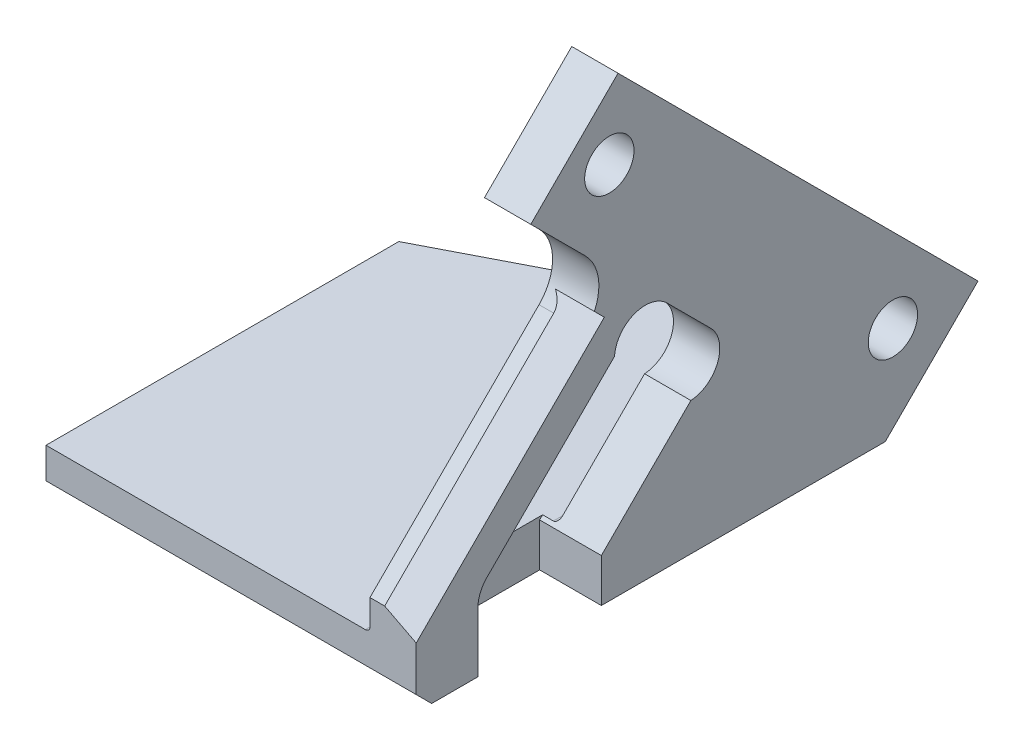
ISO-10303-21;
HEADER;
FILE_DESCRIPTION(('STEP AP214'),'2;1');
FILE_NAME('part.step','',(''),(''),'','','');
FILE_SCHEMA(('AUTOMOTIVE_DESIGN { 1 0 10303 214 1 1 1 1 }'));
ENDSEC;
DATA;
#1=APPLICATION_CONTEXT('core data for automotive mechanical design processes');
#2=APPLICATION_PROTOCOL_DEFINITION('international standard','automotive_design',2000,#1);
#3=PRODUCT_CONTEXT('',#1,'mechanical');
#4=PRODUCT('Part','Part','',(#3));
#5=PRODUCT_RELATED_PRODUCT_CATEGORY('part','',(#4));
#6=PRODUCT_DEFINITION_FORMATION('','',#4);
#7=PRODUCT_DEFINITION_CONTEXT('part definition',#1,'design');
#8=PRODUCT_DEFINITION('design','',#6,#7);
#9=PRODUCT_DEFINITION_SHAPE('','',#8);
#10=(LENGTH_UNIT() NAMED_UNIT(*) SI_UNIT(.MILLI.,.METRE.));
#11=(NAMED_UNIT(*) PLANE_ANGLE_UNIT() SI_UNIT($,.RADIAN.));
#12=(NAMED_UNIT(*) SI_UNIT($,.STERADIAN.) SOLID_ANGLE_UNIT());
#13=UNCERTAINTY_MEASURE_WITH_UNIT(LENGTH_MEASURE(1.E-05),#10,'distance_accuracy_value','');
#14=(GEOMETRIC_REPRESENTATION_CONTEXT(3) GLOBAL_UNCERTAINTY_ASSIGNED_CONTEXT((#13)) GLOBAL_UNIT_ASSIGNED_CONTEXT((#10,
#11,#12)) REPRESENTATION_CONTEXT('',''));
#15=CARTESIAN_POINT('',(0.,0.,0.));
#16=DIRECTION('',(0.,0.,1.));
#17=DIRECTION('',(1.,0.,0.));
#18=AXIS2_PLACEMENT_3D('',#15,#16,#17);
#19=CARTESIAN_POINT('',(3.,35.,40.));
#20=DIRECTION('',(-1.,0.,0.));
#21=DIRECTION('',(0.,-1.,0.));
#22=AXIS2_PLACEMENT_3D('',#19,#20,#21);
#23=PLANE('',#22);
#24=CARTESIAN_POINT('',(3.,3.1084026149607,9.09843368765678));
#25=DIRECTION('',(1.,0.,0.));
#26=DIRECTION('',(0.,0.,-1.));
#27=AXIS2_PLACEMENT_3D('',#24,#25,#26);
#28=CIRCLE('',#27,1.6);
#29=CARTESIAN_POINT('',(3.,3.1084026149607,7.49843368765678));
#30=VERTEX_POINT('',#29);
#31=EDGE_CURVE('E812',#30,#30,#28,.T.);
#32=ORIENTED_EDGE('',*,*,#31,.F.);
#33=EDGE_LOOP('',(#32));
#34=FACE_BOUND('',#33,.T.);
#35=DIRECTION('',(0.,1.,0.));
#36=VECTOR('',#35,1.);
#37=CARTESIAN_POINT('',(3.,35.,40.));
#38=LINE('',#37,#36);
#39=CARTESIAN_POINT('',(3.00000000000001,-1.99999999999998,40.));
#40=VERTEX_POINT('',#39);
#41=CARTESIAN_POINT('',(3.00000000000001,0.896265221277836,40.));
#42=VERTEX_POINT('',#41);
#43=EDGE_CURVE('E349',#40,#42,#38,.T.);
#44=ORIENTED_EDGE('',*,*,#43,.F.);
#45=DIRECTION('',(0.,-0.707106781186545,-0.70710678118655));
#46=VECTOR('',#45,1.);
#47=CARTESIAN_POINT('',(3.00000000000001,-1.99999999999999,40.));
#48=LINE('',#47,#46);
#49=CARTESIAN_POINT('',(3.00000000000001,-3.,39.));
#50=VERTEX_POINT('',#49);
#51=EDGE_CURVE('E401',#40,#50,#48,.T.);
#52=ORIENTED_EDGE('',*,*,#51,.T.);
#53=DIRECTION('',(0.,0.,-1.));
#54=VECTOR('',#53,1.);
#55=CARTESIAN_POINT('',(3.00000000000001,-3.,40.));
#56=LINE('',#55,#54);
#57=CARTESIAN_POINT('',(3.00000000000001,-3.,36.));
#58=VERTEX_POINT('',#57);
#59=EDGE_CURVE('E354',#50,#58,#56,.T.);
#60=ORIENTED_EDGE('',*,*,#59,.T.);
#61=DIRECTION('',(0.,-1.,0.));
#62=VECTOR('',#61,1.);
#63=CARTESIAN_POINT('',(3.,11.6724657096209,36.));
#64=LINE('',#63,#62);
#65=CARTESIAN_POINT('',(3.,0.87867965644039,36.));
#66=VERTEX_POINT('',#65);
#67=EDGE_CURVE('E266',#66,#58,#64,.T.);
#68=ORIENTED_EDGE('',*,*,#67,.F.);
#69=CARTESIAN_POINT('',(3.,0.878679656440391,34.));
#70=DIRECTION('',(1.,0.,0.));
#71=DIRECTION('',(0.,1.,0.));
#72=AXIS2_PLACEMENT_3D('',#69,#70,#71);
#73=CIRCLE('',#72,2.);
#74=CARTESIAN_POINT('',(3.,2.29289321881349,35.4142135623731));
#75=VERTEX_POINT('',#74);
#76=EDGE_CURVE('E263',#75,#66,#73,.T.);
#77=ORIENTED_EDGE('',*,*,#76,.F.);
#78=DIRECTION('',(0.,-0.707106781186548,0.707106781186547));
#79=VECTOR('',#78,1.);
#80=CARTESIAN_POINT('',(3.,32.0529975628686,5.65410921831808));
#81=LINE('',#80,#79);
#82=CARTESIAN_POINT('',(3.,10.5602746676308,27.1468321135558));
#83=VERTEX_POINT('',#82);
#84=EDGE_CURVE('E260',#83,#75,#81,.T.);
#85=ORIENTED_EDGE('',*,*,#84,.F.);
#86=CARTESIAN_POINT('',(3.,10.4350288425444,25.1507575950825));
#87=DIRECTION('',(1.,0.,0.));
#88=DIRECTION('',(0.,1.,0.));
#89=AXIS2_PLACEMENT_3D('',#86,#87,#88);
#90=CIRCLE('',#89,2.);
#91=CARTESIAN_POINT('',(3.,11.8492424049175,23.7365440327094));
#92=VERTEX_POINT('',#91);
#93=EDGE_CURVE('E257',#92,#83,#90,.T.);
#94=ORIENTED_EDGE('',*,*,#93,.F.);
#95=DIRECTION('',(0.,0.707106781186548,0.707106781186547));
#96=VECTOR('',#95,1.);
#97=CARTESIAN_POINT('',(3.00000000000001,-7.47062927655033,4.41667235124159));
#98=LINE('',#97,#96);
#99=CARTESIAN_POINT('',(3.,9.02081528017135,20.9081169079632));
#100=VERTEX_POINT('',#99);
#101=EDGE_CURVE('E243',#100,#92,#98,.T.);
#102=ORIENTED_EDGE('',*,*,#101,.F.);
#103=CARTESIAN_POINT('',(3.,7.60660171779825,22.3223304703363));
#104=DIRECTION('',(1.,0.,0.));
#105=DIRECTION('',(0.,1.,0.));
#106=AXIS2_PLACEMENT_3D('',#103,#104,#105);
#107=CIRCLE('',#106,2.);
#108=CARTESIAN_POINT('',(3.,5.61052719932495,22.19708464525));
#109=VERTEX_POINT('',#108);
#110=EDGE_CURVE('E247',#109,#100,#107,.T.);
#111=ORIENTED_EDGE('',*,*,#110,.F.);
#112=DIRECTION('',(0.,0.707106781186547,-0.707106781186548));
#113=VECTOR('',#112,1.);
#114=CARTESIAN_POINT('',(3.,27.1032500945627,0.704361750012202));
#115=LINE('',#114,#113);
#116=CARTESIAN_POINT('',(3.,-0.192388155425081,28.));
#117=VERTEX_POINT('',#116);
#118=EDGE_CURVE('E272',#117,#109,#115,.T.);
#119=ORIENTED_EDGE('',*,*,#118,.F.);
#120=DIRECTION('',(0.,-1.,0.));
#121=VECTOR('',#120,1.);
#122=CARTESIAN_POINT('',(3.,11.6724657096209,28.));
#123=LINE('',#122,#121);
#124=CARTESIAN_POINT('',(3.00000000000001,-3.,28.));
#125=VERTEX_POINT('',#124);
#126=EDGE_CURVE('E269',#117,#125,#123,.T.);
#127=ORIENTED_EDGE('',*,*,#126,.T.);
#128=CARTESIAN_POINT('',(3.00000000000001,-3.,9.59440840897853));
#129=VERTEX_POINT('',#128);
#130=EDGE_CURVE('E353',#125,#129,#56,.T.);
#131=ORIENTED_EDGE('',*,*,#130,.T.);
#132=DIRECTION('',(0.,0.707106781186549,-0.707106781186547));
#133=VECTOR('',#132,1.);
#134=CARTESIAN_POINT('',(3.,0.797204204489303,5.79720420448923));
#135=LINE('',#134,#133);
#136=CARTESIAN_POINT('',(3.,3.0104076400857,3.58400076889284));
#137=VERTEX_POINT('',#136);
#138=EDGE_CURVE('E335',#129,#137,#135,.T.);
#139=ORIENTED_EDGE('',*,*,#138,.T.);
#140=DIRECTION('',(0.,0.707106781186546,0.707106781186549));
#141=VECTOR('',#140,1.);
#142=CARTESIAN_POINT('',(3.,37.2132034355964,37.7867965644036));
#143=LINE('',#142,#141);
#144=CARTESIAN_POINT('',(3.,26.3449314192417,26.9185245480489));
#145=VERTEX_POINT('',#144);
#146=EDGE_CURVE('E337',#137,#145,#143,.T.);
#147=ORIENTED_EDGE('',*,*,#146,.T.);
#148=DIRECTION('',(0.,-0.707106781186548,0.707106781186547));
#149=VECTOR('',#148,1.);
#150=CARTESIAN_POINT('',(3.,24.1317279836453,29.1317279836453));
#151=LINE('',#150,#149);
#152=CARTESIAN_POINT('',(3.,20.6880771697493,32.5753787975413));
#153=VERTEX_POINT('',#152);
#154=EDGE_CURVE('E339',#145,#153,#151,.T.);
#155=ORIENTED_EDGE('',*,*,#154,.T.);
#156=DIRECTION('',(0.,-0.707106781186546,-0.707106781186549));
#157=VECTOR('',#156,1.);
#158=CARTESIAN_POINT('',(3.,31.556349186104,43.443650813896));
#159=LINE('',#158,#157);
#160=CARTESIAN_POINT('',(3.,17.1525432638166,29.0398448916086));
#161=VERTEX_POINT('',#160);
#162=EDGE_CURVE('E341',#153,#161,#159,.T.);
#163=ORIENTED_EDGE('',*,*,#162,.T.);
#164=CARTESIAN_POINT('',(3.,15.031222920257,31.1611652351682));
#165=DIRECTION('',(-1.,0.,0.));
#166=DIRECTION('',(0.,-1.,0.));
#167=AXIS2_PLACEMENT_3D('',#164,#165,#166);
#168=CIRCLE('',#167,2.99999999999999);
#169=CARTESIAN_POINT('',(3.,13.7383297014435,28.4540584539817));
#170=VERTEX_POINT('',#169);
#171=EDGE_CURVE('E236',#161,#170,#168,.T.);
#172=ORIENTED_EDGE('',*,*,#171,.T.);
#173=DIRECTION('',(0.,0.707106781186546,0.707106781186549));
#174=VECTOR('',#173,1.);
#175=CARTESIAN_POINT('',(3.,19.2738636073762,33.9895923599144));
#176=LINE('',#175,#174);
#177=CARTESIAN_POINT('',(3.00000000000001,13.0902682343699,27.805996986908));
#178=VERTEX_POINT('',#177);
#179=EDGE_CURVE('E216',#178,#170,#176,.T.);
#180=ORIENTED_EDGE('',*,*,#179,.F.);
#181=DIRECTION('',(0.,0.707106781186549,-0.707106781186546));
#182=VECTOR('',#181,1.);
#183=CARTESIAN_POINT('',(3.00000000000001,-1.05186738936109,41.948132610639));
#184=LINE('',#183,#182);
#185=EDGE_CURVE('E225',#42,#178,#184,.T.);
#186=ORIENTED_EDGE('',*,*,#185,.F.);
#187=EDGE_LOOP('',(#44,#52,#60,#68,#77,#85,#94,#102,#111,#119,#127,#131,#139,#147,#155,#163,
#172,#180,#186));
#188=FACE_BOUND('',#187,.T.);
#189=CARTESIAN_POINT('',(3.,21.4931789258109,27.483209998507));
#190=DIRECTION('',(1.,0.,0.));
#191=DIRECTION('',(0.,0.,-1.));
#192=AXIS2_PLACEMENT_3D('',#189,#190,#191);
#193=CIRCLE('',#192,1.6);
#194=CARTESIAN_POINT('',(3.,21.4931789258109,25.883209998507));
#195=VERTEX_POINT('',#194);
#196=EDGE_CURVE('E818',#195,#195,#193,.T.);
#197=ORIENTED_EDGE('',*,*,#196,.F.);
#198=EDGE_LOOP('',(#197));
#199=FACE_BOUND('',#198,.T.);
#200=ADVANCED_FACE('F32',(#34,#188,#199),#23,.F.);
#201=CARTESIAN_POINT('',(-101.458044782457,15.031222920257,31.1611652351682));
#202=DIRECTION('',(1.,0.,0.));
#203=DIRECTION('',(0.,0.,-1.));
#204=AXIS2_PLACEMENT_3D('',#201,#202,#203);
#205=CYLINDRICAL_SURFACE('',#204,2.99999999999999);
#206=CARTESIAN_POINT('',(-7.28909533847806,15.031222920257,31.1611652351682));
#207=DIRECTION('',(0.342020143325667,0.664463024388674,0.664463024388676));
#208=DIRECTION('',(0.939692620785909,-0.241844762647974,-0.241844762647975));
#209=AXIS2_PLACEMENT_3D('',#206,#207,#208);
#210=ELLIPSE('',#209,8.77141320048928,2.99999999999999);
#211=CARTESIAN_POINT('',(0.481944319335153,13.7383297014435,28.4540584539817));
#212=VERTEX_POINT('',#211);
#213=CARTESIAN_POINT('',(0.953336919885841,12.9099025766973,29.0398448916086));
#214=VERTEX_POINT('',#213);
#215=EDGE_CURVE('E241',#212,#214,#210,.F.);
#216=ORIENTED_EDGE('',*,*,#215,.F.);
#217=DIRECTION('',(1.,0.,0.));
#218=VECTOR('',#217,1.);
#219=CARTESIAN_POINT('',(-101.458044782457,13.7383297014435,28.4540584539817));
#220=LINE('',#219,#218);
#221=EDGE_CURVE('E218',#212,#170,#220,.T.);
#222=ORIENTED_EDGE('',*,*,#221,.T.);
#223=ORIENTED_EDGE('',*,*,#171,.F.);
#224=DIRECTION('',(1.,0.,0.));
#225=VECTOR('',#224,1.);
#226=CARTESIAN_POINT('',(-101.458044782457,17.1525432638166,29.0398448916086));
#227=LINE('',#226,#225);
#228=CARTESIAN_POINT('',(0.,17.1525432638166,29.0398448916086));
#229=VERTEX_POINT('',#228);
#230=EDGE_CURVE('E325',#229,#161,#227,.T.);
#231=ORIENTED_EDGE('',*,*,#230,.F.);
#232=CARTESIAN_POINT('',(0.,15.031222920257,31.1611652351682));
#233=DIRECTION('',(1.,0.,0.));
#234=DIRECTION('',(0.,0.,-1.));
#235=AXIS2_PLACEMENT_3D('',#232,#233,#234);
#236=CIRCLE('',#235,2.99999999999999);
#237=CARTESIAN_POINT('',(0.,12.9099025766973,29.0398448916086));
#238=VERTEX_POINT('',#237);
#239=EDGE_CURVE('E372',#238,#229,#236,.T.);
#240=ORIENTED_EDGE('',*,*,#239,.F.);
#241=DIRECTION('',(1.,0.,0.));
#242=VECTOR('',#241,1.);
#243=CARTESIAN_POINT('',(-101.458044782457,12.9099025766973,29.0398448916086));
#244=LINE('',#243,#242);
#245=EDGE_CURVE('E328',#238,#214,#244,.T.);
#246=ORIENTED_EDGE('',*,*,#245,.T.);
#247=EDGE_LOOP('',(#216,#222,#223,#231,#240,#246));
#248=FACE_BOUND('',#247,.T.);
#249=ADVANCED_FACE('F466',(#248),#205,.F.);
#250=CARTESIAN_POINT('',(-101.458044782457,1.94974746830583,40.));
#251=DIRECTION('',(0.,-0.707106781186546,-0.707106781186549));
#252=DIRECTION('',(0.,0.707106781186549,-0.707106781186546));
#253=AXIS2_PLACEMENT_3D('',#250,#251,#252);
#254=PLANE('',#253);
#255=DIRECTION('',(0.,-0.707106781186549,0.707106781186546));
#256=VECTOR('',#255,1.);
#257=CARTESIAN_POINT('',(0.953336919885833,1.9497474683058,40.0000000000001));
#258=LINE('',#257,#256);
#259=CARTESIAN_POINT('',(0.953336919885838,1.94974746830583,40.));
#260=VERTEX_POINT('',#259);
#261=EDGE_CURVE('E231',#214,#260,#258,.T.);
#262=ORIENTED_EDGE('',*,*,#261,.F.);
#263=ORIENTED_EDGE('',*,*,#245,.F.);
#264=DIRECTION('',(0.,0.707106781186549,-0.707106781186546));
#265=VECTOR('',#264,1.);
#266=CARTESIAN_POINT('',(0.,0.974873734152913,40.9748737341529));
#267=LINE('',#266,#265);
#268=CARTESIAN_POINT('',(0.,1.94974746830583,40.));
#269=VERTEX_POINT('',#268);
#270=EDGE_CURVE('E331',#269,#238,#267,.T.);
#271=ORIENTED_EDGE('',*,*,#270,.F.);
#272=DIRECTION('',(1.,0.,0.));
#273=VECTOR('',#272,1.);
#274=CARTESIAN_POINT('',(0.,1.94974746830583,40.));
#275=LINE('',#274,#273);
#276=EDGE_CURVE('E361',#269,#260,#275,.T.);
#277=ORIENTED_EDGE('',*,*,#276,.T.);
#278=EDGE_LOOP('',(#262,#263,#271,#277));
#279=FACE_BOUND('',#278,.T.);
#280=ADVANCED_FACE('F470',(#279),#254,.F.);
#281=CARTESIAN_POINT('',(0.,0.,40.));
#282=DIRECTION('',(0.,0.,1.));
#283=DIRECTION('',(1.,0.,0.));
#284=AXIS2_PLACEMENT_3D('',#281,#282,#283);
#285=PLANE('',#284);
#286=DIRECTION('',(0.,-1.,0.));
#287=VECTOR('',#286,1.);
#288=CARTESIAN_POINT('',(-21.,-3.,40.));
#289=LINE('',#288,#287);
#290=CARTESIAN_POINT('',(-21.,0.,40.));
#291=VERTEX_POINT('',#290);
#292=CARTESIAN_POINT('',(-21.,-1.99999999999999,40.));
#293=VERTEX_POINT('',#292);
#294=EDGE_CURVE('E346',#291,#293,#289,.T.);
#295=ORIENTED_EDGE('',*,*,#294,.T.);
#296=DIRECTION('',(1.,0.,0.));
#297=VECTOR('',#296,1.);
#298=CARTESIAN_POINT('',(3.00000000000001,-1.99999999999999,40.));
#299=LINE('',#298,#297);
#300=EDGE_CURVE('E398',#293,#40,#299,.T.);
#301=ORIENTED_EDGE('',*,*,#300,.T.);
#302=ORIENTED_EDGE('',*,*,#43,.T.);
#303=DIRECTION('',(-0.889126490715989,0.457661538155732,0.));
#304=VECTOR('',#303,1.);
#305=CARTESIAN_POINT('',(0.993069595728721,1.92929580284409,40.));
#306=LINE('',#305,#304);
#307=EDGE_CURVE('E228',#42,#260,#306,.T.);
#308=ORIENTED_EDGE('',*,*,#307,.T.);
#309=ORIENTED_EDGE('',*,*,#276,.F.);
#310=DIRECTION('',(0.,-1.,0.));
#311=VECTOR('',#310,1.);
#312=CARTESIAN_POINT('',(0.,0.,40.));
#313=LINE('',#312,#311);
#314=CARTESIAN_POINT('',(0.,0.3,40.));
#315=VERTEX_POINT('',#314);
#316=EDGE_CURVE('E351',#269,#315,#313,.T.);
#317=ORIENTED_EDGE('',*,*,#316,.T.);
#318=CARTESIAN_POINT('',(-0.300000000000002,0.3,40.));
#319=DIRECTION('',(0.,0.,1.));
#320=DIRECTION('',(1.,0.,0.));
#321=AXIS2_PLACEMENT_3D('',#318,#319,#320);
#322=CIRCLE('',#321,0.3);
#323=CARTESIAN_POINT('',(-0.300000000000002,0.,40.));
#324=VERTEX_POINT('',#323);
#325=EDGE_CURVE('E11',#315,#324,#322,.F.);
#326=ORIENTED_EDGE('',*,*,#325,.T.);
#327=DIRECTION('',(-1.,0.,0.));
#328=VECTOR('',#327,1.);
#329=CARTESIAN_POINT('',(-21.,0.,40.));
#330=LINE('',#329,#328);
#331=EDGE_CURVE('E344',#324,#291,#330,.T.);
#332=ORIENTED_EDGE('',*,*,#331,.T.);
#333=EDGE_LOOP('',(#295,#301,#302,#308,#309,#317,#326,#332));
#334=FACE_BOUND('',#333,.T.);
#335=ADVANCED_FACE('F429',(#334),#285,.T.);
#336=CARTESIAN_POINT('',(3.00000000000001,-3.,40.));
#337=DIRECTION('',(0.,1.,0.));
#338=DIRECTION('',(-1.,0.,0.));
#339=AXIS2_PLACEMENT_3D('',#336,#337,#338);
#340=PLANE('',#339);
#341=ORIENTED_EDGE('',*,*,#59,.F.);
#342=DIRECTION('',(-1.,0.,0.));
#343=VECTOR('',#342,1.);
#344=CARTESIAN_POINT('',(-21.,-3.,39.));
#345=LINE('',#344,#343);
#346=CARTESIAN_POINT('',(-21.,-3.,39.));
#347=VERTEX_POINT('',#346);
#348=EDGE_CURVE('E403',#50,#347,#345,.T.);
#349=ORIENTED_EDGE('',*,*,#348,.T.);
#350=DIRECTION('',(0.,0.,-1.));
#351=VECTOR('',#350,1.);
#352=CARTESIAN_POINT('',(-21.,-3.,40.));
#353=LINE('',#352,#351);
#354=CARTESIAN_POINT('',(-21.,-3.,20.1292308792585));
#355=VERTEX_POINT('',#354);
#356=EDGE_CURVE('E356',#347,#355,#353,.T.);
#357=ORIENTED_EDGE('',*,*,#356,.T.);
#358=DIRECTION('',(-0.889126490715986,0.,0.457661538155737));
#359=VECTOR('',#358,1.);
#360=CARTESIAN_POINT('',(-10.1126914514763,-3.,14.5251886774779));
#361=LINE('',#360,#359);
#362=CARTESIAN_POINT('',(-0.533369198858679,-3.,9.59440840897854));
#363=VERTEX_POINT('',#362);
#364=EDGE_CURVE('E374',#363,#355,#361,.T.);
#365=ORIENTED_EDGE('',*,*,#364,.F.);
#366=DIRECTION('',(1.,0.,0.));
#367=VECTOR('',#366,1.);
#368=CARTESIAN_POINT('',(-101.458044782457,-3.,9.59440840897853));
#369=LINE('',#368,#367);
#370=EDGE_CURVE('E314',#363,#129,#369,.T.);
#371=ORIENTED_EDGE('',*,*,#370,.T.);
#372=ORIENTED_EDGE('',*,*,#130,.F.);
#373=DIRECTION('',(1.,0.,0.));
#374=VECTOR('',#373,1.);
#375=CARTESIAN_POINT('',(-0.999999999999995,-3.,28.));
#376=LINE('',#375,#374);
#377=CARTESIAN_POINT('',(-0.999999999999995,-3.,28.));
#378=VERTEX_POINT('',#377);
#379=EDGE_CURVE('E284',#378,#125,#376,.T.);
#380=ORIENTED_EDGE('',*,*,#379,.F.);
#381=DIRECTION('',(0.,0.,-1.));
#382=VECTOR('',#381,1.);
#383=CARTESIAN_POINT('',(-0.999999999999995,-3.,-14.7264226349296));
#384=LINE('',#383,#382);
#385=CARTESIAN_POINT('',(-0.999999999999995,-3.,36.));
#386=VERTEX_POINT('',#385);
#387=EDGE_CURVE('E246',#386,#378,#384,.T.);
#388=ORIENTED_EDGE('',*,*,#387,.F.);
#389=DIRECTION('',(1.,0.,0.));
#390=VECTOR('',#389,1.);
#391=CARTESIAN_POINT('',(-0.999999999999995,-3.,36.));
#392=LINE('',#391,#390);
#393=EDGE_CURVE('E286',#386,#58,#392,.T.);
#394=ORIENTED_EDGE('',*,*,#393,.T.);
#395=EDGE_LOOP('',(#341,#349,#357,#365,#371,#372,#380,#388,#394));
#396=FACE_BOUND('',#395,.T.);
#397=ADVANCED_FACE('F444',(#396),#340,.F.);
#398=CARTESIAN_POINT('',(-101.458044782457,3.01040764008571,3.58400076889284));
#399=DIRECTION('',(0.,0.707106781186546,0.707106781186548));
#400=DIRECTION('',(0.,-0.707106781186549,0.707106781186547));
#401=AXIS2_PLACEMENT_3D('',#398,#399,#400);
#402=PLANE('',#401);
#403=DIRECTION('',(0.,-0.707106781186549,0.707106781186546));
#404=VECTOR('',#403,1.);
#405=CARTESIAN_POINT('',(-0.533369198858626,3.01040764008571,3.58400076889284));
#406=LINE('',#405,#404);
#407=CARTESIAN_POINT('',(-0.533369198858611,0.,6.59440840897853));
#408=VERTEX_POINT('',#407);
#409=EDGE_CURVE('E305',#408,#363,#406,.T.);
#410=ORIENTED_EDGE('',*,*,#409,.F.);
#411=DIRECTION('',(-1.,0.,0.));
#412=VECTOR('',#411,1.);
#413=CARTESIAN_POINT('',(-21.,0.,6.59440840897853));
#414=LINE('',#413,#412);
#415=CARTESIAN_POINT('',(-0.300000000000002,0.,6.59440840897853));
#416=VERTEX_POINT('',#415);
#417=EDGE_CURVE('E333',#416,#408,#414,.T.);
#418=ORIENTED_EDGE('',*,*,#417,.F.);
#419=CARTESIAN_POINT('',(-0.300000000000002,0.3,6.29440840897854));
#420=DIRECTION('',(0.,0.707106781186546,0.707106781186548));
#421=DIRECTION('',(0.,-0.707106781186549,0.707106781186547));
#422=AXIS2_PLACEMENT_3D('',#419,#420,#421);
#423=ELLIPSE('',#422,0.424264068711928,0.3);
#424=CARTESIAN_POINT('',(0.,0.300000000000005,6.29440840897854));
#425=VERTEX_POINT('',#424);
#426=EDGE_CURVE('E47',#416,#425,#423,.T.);
#427=ORIENTED_EDGE('',*,*,#426,.T.);
#428=DIRECTION('',(0.,-0.707106781186549,0.707106781186547));
#429=VECTOR('',#428,1.);
#430=CARTESIAN_POINT('',(0.,-16.7027957955107,23.2972042044892));
#431=LINE('',#430,#429);
#432=CARTESIAN_POINT('',(0.,3.01040764008571,3.58400076889284));
#433=VERTEX_POINT('',#432);
#434=EDGE_CURVE('E364',#433,#425,#431,.T.);
#435=ORIENTED_EDGE('',*,*,#434,.F.);
#436=DIRECTION('',(1.,0.,0.));
#437=VECTOR('',#436,1.);
#438=CARTESIAN_POINT('',(-101.458044782457,3.01040764008571,3.58400076889284));
#439=LINE('',#438,#437);
#440=EDGE_CURVE('E313',#433,#137,#439,.T.);
#441=ORIENTED_EDGE('',*,*,#440,.T.);
#442=ORIENTED_EDGE('',*,*,#138,.F.);
#443=ORIENTED_EDGE('',*,*,#370,.F.);
#444=EDGE_LOOP('',(#410,#418,#427,#435,#441,#442,#443));
#445=FACE_BOUND('',#444,.T.);
#446=ADVANCED_FACE('F447',(#445),#402,.F.);
#447=CARTESIAN_POINT('',(-21.,0.,40.));
#448=DIRECTION('',(0.,-1.,0.));
#449=DIRECTION('',(0.,0.,-1.));
#450=AXIS2_PLACEMENT_3D('',#447,#448,#449);
#451=PLANE('',#450);
#452=DIRECTION('',(1.,0.,0.));
#453=VECTOR('',#452,1.);
#454=CARTESIAN_POINT('',(-21.,0.,27.8076118445749));
#455=LINE('',#454,#453);
#456=CARTESIAN_POINT('',(-0.999999999999996,0.,27.8076118445749));
#457=VERTEX_POINT('',#456);
#458=CARTESIAN_POINT('',(-0.300000000000002,0.,27.8076118445749));
#459=VERTEX_POINT('',#458);
#460=EDGE_CURVE('E298',#457,#459,#455,.T.);
#461=ORIENTED_EDGE('',*,*,#460,.T.);
#462=DIRECTION('',(0.,0.,-1.));
#463=VECTOR('',#462,1.);
#464=CARTESIAN_POINT('',(-0.300000000000002,0.,6.59440840897854));
#465=LINE('',#464,#463);
#466=EDGE_CURVE('E410',#459,#416,#465,.T.);
#467=ORIENTED_EDGE('',*,*,#466,.T.);
#468=ORIENTED_EDGE('',*,*,#417,.T.);
#469=DIRECTION('',(0.889126490715986,0.,-0.457661538155737));
#470=VECTOR('',#469,1.);
#471=CARTESIAN_POINT('',(-30.3065504393748,0.,21.9196068645454));
#472=LINE('',#471,#470);
#473=CARTESIAN_POINT('',(-21.,0.,17.1292308792585));
#474=VERTEX_POINT('',#473);
#475=EDGE_CURVE('E308',#474,#408,#472,.T.);
#476=ORIENTED_EDGE('',*,*,#475,.F.);
#477=DIRECTION('',(0.,0.,-1.));
#478=VECTOR('',#477,1.);
#479=CARTESIAN_POINT('',(-21.,0.,40.));
#480=LINE('',#479,#478);
#481=EDGE_CURVE('E358',#291,#474,#480,.T.);
#482=ORIENTED_EDGE('',*,*,#481,.F.);
#483=ORIENTED_EDGE('',*,*,#331,.F.);
#484=DIRECTION('',(0.,0.,-1.));
#485=VECTOR('',#484,1.);
#486=CARTESIAN_POINT('',(-0.300000000000002,0.,36.));
#487=LINE('',#486,#485);
#488=CARTESIAN_POINT('',(-0.300000000000002,0.,36.));
#489=VERTEX_POINT('',#488);
#490=EDGE_CURVE('E407',#324,#489,#487,.T.);
#491=ORIENTED_EDGE('',*,*,#490,.T.);
#492=DIRECTION('',(-1.,0.,0.));
#493=VECTOR('',#492,1.);
#494=CARTESIAN_POINT('',(-21.,0.,36.));
#495=LINE('',#494,#493);
#496=CARTESIAN_POINT('',(-0.999999999999995,0.,36.));
#497=VERTEX_POINT('',#496);
#498=EDGE_CURVE('E279',#489,#497,#495,.T.);
#499=ORIENTED_EDGE('',*,*,#498,.T.);
#500=DIRECTION('',(0.,0.,1.));
#501=VECTOR('',#500,1.);
#502=CARTESIAN_POINT('',(-0.999999999999997,0.,40.));
#503=LINE('',#502,#501);
#504=EDGE_CURVE('E301',#457,#497,#503,.T.);
#505=ORIENTED_EDGE('',*,*,#504,.F.);
#506=EDGE_LOOP('',(#461,#467,#468,#476,#482,#483,#491,#499,#505));
#507=FACE_BOUND('',#506,.T.);
#508=ADVANCED_FACE('F433',(#507),#451,.F.);
#509=CARTESIAN_POINT('',(-21.,-3.,40.));
#510=DIRECTION('',(1.,0.,0.));
#511=DIRECTION('',(0.,0.,-1.));
#512=AXIS2_PLACEMENT_3D('',#509,#510,#511);
#513=PLANE('',#512);
#514=ORIENTED_EDGE('',*,*,#356,.F.);
#515=DIRECTION('',(0.,0.707106781186545,0.70710678118655));
#516=VECTOR('',#515,1.);
#517=CARTESIAN_POINT('',(-21.,-1.99999999999999,40.));
#518=LINE('',#517,#516);
#519=EDGE_CURVE('E405',#347,#293,#518,.T.);
#520=ORIENTED_EDGE('',*,*,#519,.T.);
#521=ORIENTED_EDGE('',*,*,#294,.F.);
#522=ORIENTED_EDGE('',*,*,#481,.T.);
#523=DIRECTION('',(0.,-0.707106781186549,0.707106781186546));
#524=VECTOR('',#523,1.);
#525=CARTESIAN_POINT('',(-21.,8.2778188752257,8.85141200403285));
#526=LINE('',#525,#524);
#527=EDGE_CURVE('E304',#474,#355,#526,.T.);
#528=ORIENTED_EDGE('',*,*,#527,.T.);
#529=EDGE_LOOP('',(#514,#520,#521,#522,#528));
#530=FACE_BOUND('',#529,.T.);
#531=ADVANCED_FACE('F437',(#530),#513,.F.);
#532=CARTESIAN_POINT('',(-101.458044782457,17.1525432638166,29.0398448916086));
#533=DIRECTION('',(0.,0.707106781186549,-0.707106781186546));
#534=DIRECTION('',(0.,0.707106781186546,0.707106781186549));
#535=AXIS2_PLACEMENT_3D('',#532,#533,#534);
#536=PLANE('',#535);
#537=ORIENTED_EDGE('',*,*,#162,.F.);
#538=DIRECTION('',(1.,0.,0.));
#539=VECTOR('',#538,1.);
#540=CARTESIAN_POINT('',(-101.458044782457,20.6880771697493,32.5753787975413));
#541=LINE('',#540,#539);
#542=CARTESIAN_POINT('',(0.,20.6880771697493,32.5753787975413));
#543=VERTEX_POINT('',#542);
#544=EDGE_CURVE('E322',#543,#153,#541,.T.);
#545=ORIENTED_EDGE('',*,*,#544,.F.);
#546=DIRECTION('',(0.,0.707106781186546,0.707106781186549));
#547=VECTOR('',#546,1.);
#548=CARTESIAN_POINT('',(0.,14.0563491861041,25.943650813896));
#549=LINE('',#548,#547);
#550=EDGE_CURVE('E370',#229,#543,#549,.T.);
#551=ORIENTED_EDGE('',*,*,#550,.F.);
#552=ORIENTED_EDGE('',*,*,#230,.T.);
#553=EDGE_LOOP('',(#537,#545,#551,#552));
#554=FACE_BOUND('',#553,.T.);
#555=ADVANCED_FACE('F461',(#554),#536,.F.);
#556=CARTESIAN_POINT('',(-101.458044782457,20.6880771697493,32.5753787975413));
#557=DIRECTION('',(0.,-0.707106781186547,-0.707106781186548));
#558=DIRECTION('',(0.,0.707106781186548,-0.707106781186547));
#559=AXIS2_PLACEMENT_3D('',#556,#557,#558);
#560=PLANE('',#559);
#561=ORIENTED_EDGE('',*,*,#154,.F.);
#562=DIRECTION('',(1.,0.,0.));
#563=VECTOR('',#562,1.);
#564=CARTESIAN_POINT('',(-101.458044782457,26.3449314192417,26.9185245480489));
#565=LINE('',#564,#563);
#566=CARTESIAN_POINT('',(0.,26.3449314192417,26.9185245480489));
#567=VERTEX_POINT('',#566);
#568=EDGE_CURVE('E317',#567,#145,#565,.T.);
#569=ORIENTED_EDGE('',*,*,#568,.F.);
#570=DIRECTION('',(0.,0.707106781186548,-0.707106781186547));
#571=VECTOR('',#570,1.);
#572=CARTESIAN_POINT('',(0.,6.63172798364529,46.6317279836453));
#573=LINE('',#572,#571);
#574=EDGE_CURVE('E368',#543,#567,#573,.T.);
#575=ORIENTED_EDGE('',*,*,#574,.F.);
#576=ORIENTED_EDGE('',*,*,#544,.T.);
#577=EDGE_LOOP('',(#561,#569,#575,#576));
#578=FACE_BOUND('',#577,.T.);
#579=ADVANCED_FACE('F457',(#578),#560,.F.);
#580=CARTESIAN_POINT('',(-101.458044782457,26.3449314192417,26.9185245480489));
#581=DIRECTION('',(0.,-0.707106781186549,0.707106781186546));
#582=DIRECTION('',(0.,-0.707106781186546,-0.707106781186549));
#583=AXIS2_PLACEMENT_3D('',#580,#581,#582);
#584=PLANE('',#583);
#585=ORIENTED_EDGE('',*,*,#146,.F.);
#586=ORIENTED_EDGE('',*,*,#440,.F.);
#587=DIRECTION('',(0.,-0.707106781186546,-0.707106781186549));
#588=VECTOR('',#587,1.);
#589=CARTESIAN_POINT('',(0.,19.7132034355965,20.2867965644036));
#590=LINE('',#589,#588);
#591=EDGE_CURVE('E366',#567,#433,#590,.T.);
#592=ORIENTED_EDGE('',*,*,#591,.F.);
#593=ORIENTED_EDGE('',*,*,#568,.T.);
#594=EDGE_LOOP('',(#585,#586,#592,#593));
#595=FACE_BOUND('',#594,.T.);
#596=ADVANCED_FACE('F452',(#595),#584,.F.);
#597=CARTESIAN_POINT('',(0.,0.,40.));
#598=DIRECTION('',(1.,0.,0.));
#599=DIRECTION('',(0.,0.,-1.));
#600=AXIS2_PLACEMENT_3D('',#597,#598,#599);
#601=PLANE('',#600);
#602=CARTESIAN_POINT('',(0.,21.4931789258109,27.483209998507));
#603=DIRECTION('',(1.,0.,0.));
#604=DIRECTION('',(0.,0.,-1.));
#605=AXIS2_PLACEMENT_3D('',#602,#603,#604);
#606=CIRCLE('',#605,1.725);
#607=CARTESIAN_POINT('',(0.,21.4931789258109,25.758209998507));
#608=VERTEX_POINT('',#607);
#609=EDGE_CURVE('E808',#608,#608,#606,.T.);
#610=ORIENTED_EDGE('',*,*,#609,.T.);
#611=EDGE_LOOP('',(#610));
#612=FACE_BOUND('',#611,.T.);
#613=CARTESIAN_POINT('',(0.,3.1084026149607,9.09843368765678));
#614=DIRECTION('',(1.,0.,0.));
#615=DIRECTION('',(0.,0.,-1.));
#616=AXIS2_PLACEMENT_3D('',#613,#614,#615);
#617=CIRCLE('',#616,1.725);
#618=CARTESIAN_POINT('',(0.,3.1084026149607,7.37343368765678));
#619=VERTEX_POINT('',#618);
#620=EDGE_CURVE('E811',#619,#619,#617,.T.);
#621=ORIENTED_EDGE('',*,*,#620,.T.);
#622=EDGE_LOOP('',(#621));
#623=FACE_BOUND('',#622,.T.);
#624=ORIENTED_EDGE('',*,*,#434,.T.);
#625=DIRECTION('',(0.,0.,-1.));
#626=VECTOR('',#625,1.);
#627=CARTESIAN_POINT('',(0.,0.3,27.8076118445749));
#628=LINE('',#627,#626);
#629=CARTESIAN_POINT('',(0.,0.3,27.5076118445749));
#630=VERTEX_POINT('',#629);
#631=EDGE_CURVE('E414',#425,#630,#628,.F.);
#632=ORIENTED_EDGE('',*,*,#631,.T.);
#633=DIRECTION('',(0.,0.707106781186547,-0.707106781186548));
#634=VECTOR('',#633,1.);
#635=CARTESIAN_POINT('',(0.,-6.09619407771254,33.9038059222875));
#636=LINE('',#635,#634);
#637=CARTESIAN_POINT('',(0.,5.61052719932495,22.19708464525));
#638=VERTEX_POINT('',#637);
#639=EDGE_CURVE('E394',#630,#638,#636,.T.);
#640=ORIENTED_EDGE('',*,*,#639,.T.);
#641=CARTESIAN_POINT('',(0.,7.60660171779825,22.3223304703363));
#642=DIRECTION('',(1.,0.,0.));
#643=DIRECTION('',(0.,0.,-1.));
#644=AXIS2_PLACEMENT_3D('',#641,#642,#643);
#645=CIRCLE('',#644,2.);
#646=CARTESIAN_POINT('',(0.,9.02081528017135,20.9081169079632));
#647=VERTEX_POINT('',#646);
#648=EDGE_CURVE('E391',#638,#647,#645,.T.);
#649=ORIENTED_EDGE('',*,*,#648,.T.);
#650=DIRECTION('',(0.,0.707106781186548,0.707106781186547));
#651=VECTOR('',#650,1.);
#652=CARTESIAN_POINT('',(0.,14.0563491861041,25.943650813896));
#653=LINE('',#652,#651);
#654=CARTESIAN_POINT('',(0.,11.8492424049175,23.7365440327094));
#655=VERTEX_POINT('',#654);
#656=EDGE_CURVE('E388',#647,#655,#653,.T.);
#657=ORIENTED_EDGE('',*,*,#656,.T.);
#658=CARTESIAN_POINT('',(0.,10.4350288425444,25.1507575950825));
#659=DIRECTION('',(1.,0.,0.));
#660=DIRECTION('',(0.,0.,-1.));
#661=AXIS2_PLACEMENT_3D('',#658,#659,#660);
#662=CIRCLE('',#661,2.);
#663=CARTESIAN_POINT('',(0.,10.5602746676308,27.1468321135558));
#664=VERTEX_POINT('',#663);
#665=EDGE_CURVE('E377',#655,#664,#662,.T.);
#666=ORIENTED_EDGE('',*,*,#665,.T.);
#667=DIRECTION('',(0.,-0.707106781186548,0.707106781186547));
#668=VECTOR('',#667,1.);
#669=CARTESIAN_POINT('',(0.,-1.14644660940671,38.8535533905933));
#670=LINE('',#669,#668);
#671=CARTESIAN_POINT('',(0.,2.29289321881349,35.4142135623731));
#672=VERTEX_POINT('',#671);
#673=EDGE_CURVE('E380',#664,#672,#670,.T.);
#674=ORIENTED_EDGE('',*,*,#673,.T.);
#675=CARTESIAN_POINT('',(0.,0.87867965644039,34.));
#676=DIRECTION('',(1.,0.,0.));
#677=DIRECTION('',(0.,0.,-1.));
#678=AXIS2_PLACEMENT_3D('',#675,#676,#677);
#679=CIRCLE('',#678,2.);
#680=CARTESIAN_POINT('',(0.,0.87867965644039,36.));
#681=VERTEX_POINT('',#680);
#682=EDGE_CURVE('E383',#672,#681,#679,.T.);
#683=ORIENTED_EDGE('',*,*,#682,.T.);
#684=DIRECTION('',(0.,-1.,0.));
#685=VECTOR('',#684,1.);
#686=CARTESIAN_POINT('',(0.,0.,36.));
#687=LINE('',#686,#685);
#688=CARTESIAN_POINT('',(0.,0.3,36.));
#689=VERTEX_POINT('',#688);
#690=EDGE_CURVE('E386',#681,#689,#687,.T.);
#691=ORIENTED_EDGE('',*,*,#690,.T.);
#692=DIRECTION('',(0.,0.,-1.));
#693=VECTOR('',#692,1.);
#694=CARTESIAN_POINT('',(0.,0.3,40.));
#695=LINE('',#694,#693);
#696=EDGE_CURVE('E55',#689,#315,#695,.F.);
#697=ORIENTED_EDGE('',*,*,#696,.T.);
#698=ORIENTED_EDGE('',*,*,#316,.F.);
#699=ORIENTED_EDGE('',*,*,#270,.T.);
#700=ORIENTED_EDGE('',*,*,#239,.T.);
#701=ORIENTED_EDGE('',*,*,#550,.T.);
#702=ORIENTED_EDGE('',*,*,#574,.T.);
#703=ORIENTED_EDGE('',*,*,#591,.T.);
#704=EDGE_LOOP('',(#624,#632,#640,#649,#657,#666,#674,#683,#691,#697,#698,#699,#700,#701,#702,#703));
#705=FACE_BOUND('',#704,.T.);
#706=ADVANCED_FACE('F425',(#612,#623,#705),#601,.F.);
#707=CARTESIAN_POINT('',(-21.,8.2778188752257,8.85141200403285));
#708=DIRECTION('',(-0.342020143325673,-0.664463024388672,-0.664463024388675));
#709=DIRECTION('',(0.,0.707106781186549,-0.707106781186546));
#710=AXIS2_PLACEMENT_3D('',#707,#708,#709);
#711=PLANE('',#710);
#712=ORIENTED_EDGE('',*,*,#527,.F.);
#713=ORIENTED_EDGE('',*,*,#475,.T.);
#714=ORIENTED_EDGE('',*,*,#409,.T.);
#715=ORIENTED_EDGE('',*,*,#364,.T.);
#716=EDGE_LOOP('',(#712,#713,#714,#715));
#717=FACE_BOUND('',#716,.T.);
#718=ADVANCED_FACE('F439',(#717),#711,.T.);
#719=CARTESIAN_POINT('',(-0.999999999999997,11.6724657096209,-14.7264226349296));
#720=DIRECTION('',(1.,0.,0.));
#721=DIRECTION('',(0.,1.,0.));
#722=AXIS2_PLACEMENT_3D('',#719,#720,#721);
#723=PLANE('',#722);
#724=ORIENTED_EDGE('',*,*,#504,.T.);
#725=DIRECTION('',(0.,-1.,0.));
#726=VECTOR('',#725,1.);
#727=CARTESIAN_POINT('',(-0.999999999999997,11.6724657096209,36.));
#728=LINE('',#727,#726);
#729=EDGE_CURVE('E244',#497,#386,#728,.T.);
#730=ORIENTED_EDGE('',*,*,#729,.T.);
#731=ORIENTED_EDGE('',*,*,#387,.T.);
#732=DIRECTION('',(0.,-1.,0.));
#733=VECTOR('',#732,1.);
#734=CARTESIAN_POINT('',(-0.999999999999997,11.6724657096209,28.));
#735=LINE('',#734,#733);
#736=CARTESIAN_POINT('',(-0.999999999999995,-0.192388155425081,28.));
#737=VERTEX_POINT('',#736);
#738=EDGE_CURVE('E250',#737,#378,#735,.T.);
#739=ORIENTED_EDGE('',*,*,#738,.F.);
#740=DIRECTION('',(0.,0.707106781186547,-0.707106781186548));
#741=VECTOR('',#740,1.);
#742=CARTESIAN_POINT('',(-0.999999999999999,27.1032500945627,0.704361750012202));
#743=LINE('',#742,#741);
#744=EDGE_CURVE('E252',#737,#457,#743,.T.);
#745=ORIENTED_EDGE('',*,*,#744,.T.);
#746=EDGE_LOOP('',(#724,#730,#731,#739,#745));
#747=FACE_BOUND('',#746,.T.);
#748=ADVANCED_FACE('F484',(#747),#723,.T.);
#749=CARTESIAN_POINT('',(-0.999999999999994,-7.47062927655034,4.41667235124159));
#750=DIRECTION('',(0.,0.707106781186547,-0.707106781186548));
#751=DIRECTION('',(0.,0.707106781186548,0.707106781186547));
#752=AXIS2_PLACEMENT_3D('',#749,#750,#751);
#753=PLANE('',#752);
#754=DIRECTION('',(1.,0.,0.));
#755=VECTOR('',#754,1.);
#756=CARTESIAN_POINT('',(-0.999999999999997,9.02081528017135,20.9081169079632));
#757=LINE('',#756,#755);
#758=EDGE_CURVE('E277',#647,#100,#757,.T.);
#759=ORIENTED_EDGE('',*,*,#758,.T.);
#760=ORIENTED_EDGE('',*,*,#101,.T.);
#761=DIRECTION('',(1.,0.,0.));
#762=VECTOR('',#761,1.);
#763=CARTESIAN_POINT('',(-0.999999999999997,11.8492424049175,23.7365440327094));
#764=LINE('',#763,#762);
#765=EDGE_CURVE('E255',#655,#92,#764,.T.);
#766=ORIENTED_EDGE('',*,*,#765,.F.);
#767=ORIENTED_EDGE('',*,*,#656,.F.);
#768=EDGE_LOOP('',(#759,#760,#766,#767));
#769=FACE_BOUND('',#768,.T.);
#770=ADVANCED_FACE('F503',(#769),#753,.F.);
#771=CARTESIAN_POINT('',(-0.999999999999997,7.60660171779825,22.3223304703363));
#772=DIRECTION('',(1.,0.,0.));
#773=DIRECTION('',(0.,1.,0.));
#774=AXIS2_PLACEMENT_3D('',#771,#772,#773);
#775=CYLINDRICAL_SURFACE('',#774,2.);
#776=DIRECTION('',(1.,0.,0.));
#777=VECTOR('',#776,1.);
#778=CARTESIAN_POINT('',(-0.999999999999996,5.61052719932495,22.19708464525));
#779=LINE('',#778,#777);
#780=EDGE_CURVE('E280',#638,#109,#779,.T.);
#781=ORIENTED_EDGE('',*,*,#780,.T.);
#782=ORIENTED_EDGE('',*,*,#110,.T.);
#783=ORIENTED_EDGE('',*,*,#758,.F.);
#784=ORIENTED_EDGE('',*,*,#648,.F.);
#785=EDGE_LOOP('',(#781,#782,#783,#784));
#786=FACE_BOUND('',#785,.T.);
#787=ADVANCED_FACE('F499',(#786),#775,.F.);
#788=CARTESIAN_POINT('',(-0.999999999999999,27.1032500945627,0.704361750012202));
#789=DIRECTION('',(0.,-0.707106781186548,-0.707106781186547));
#790=DIRECTION('',(0.,0.707106781186547,-0.707106781186548));
#791=AXIS2_PLACEMENT_3D('',#788,#789,#790);
#792=PLANE('',#791);
#793=ORIENTED_EDGE('',*,*,#744,.F.);
#794=DIRECTION('',(1.,0.,0.));
#795=VECTOR('',#794,1.);
#796=CARTESIAN_POINT('',(-0.999999999999995,-0.192388155425081,28.));
#797=LINE('',#796,#795);
#798=EDGE_CURVE('E282',#737,#117,#797,.T.);
#799=ORIENTED_EDGE('',*,*,#798,.T.);
#800=ORIENTED_EDGE('',*,*,#118,.T.);
#801=ORIENTED_EDGE('',*,*,#780,.F.);
#802=ORIENTED_EDGE('',*,*,#639,.F.);
#803=CARTESIAN_POINT('',(-0.300000000000002,0.3,27.5076118445749));
#804=DIRECTION('',(0.,-0.707106781186548,-0.707106781186547));
#805=DIRECTION('',(0.,-0.707106781186547,0.707106781186548));
#806=AXIS2_PLACEMENT_3D('',#803,#804,#805);
#807=ELLIPSE('',#806,0.424264068711929,0.3);
#808=EDGE_CURVE('E417',#630,#459,#807,.T.);
#809=ORIENTED_EDGE('',*,*,#808,.T.);
#810=ORIENTED_EDGE('',*,*,#460,.F.);
#811=EDGE_LOOP('',(#793,#799,#800,#801,#802,#809,#810));
#812=FACE_BOUND('',#811,.T.);
#813=ADVANCED_FACE('F480',(#812),#792,.F.);
#814=CARTESIAN_POINT('',(-0.999999999999997,11.6724657096209,36.));
#815=DIRECTION('',(0.,0.,1.));
#816=DIRECTION('',(1.,0.,0.));
#817=AXIS2_PLACEMENT_3D('',#814,#815,#816);
#818=PLANE('',#817);
#819=ORIENTED_EDGE('',*,*,#690,.F.);
#820=DIRECTION('',(1.,0.,0.));
#821=VECTOR('',#820,1.);
#822=CARTESIAN_POINT('',(-0.999999999999995,0.87867965644039,36.));
#823=LINE('',#822,#821);
#824=EDGE_CURVE('E289',#681,#66,#823,.T.);
#825=ORIENTED_EDGE('',*,*,#824,.T.);
#826=ORIENTED_EDGE('',*,*,#67,.T.);
#827=ORIENTED_EDGE('',*,*,#393,.F.);
#828=ORIENTED_EDGE('',*,*,#729,.F.);
#829=ORIENTED_EDGE('',*,*,#498,.F.);
#830=CARTESIAN_POINT('',(-0.300000000000002,0.3,36.));
#831=DIRECTION('',(0.,0.,1.));
#832=DIRECTION('',(1.,0.,0.));
#833=AXIS2_PLACEMENT_3D('',#830,#831,#832);
#834=CIRCLE('',#833,0.3);
#835=EDGE_CURVE('E40',#489,#689,#834,.T.);
#836=ORIENTED_EDGE('',*,*,#835,.T.);
#837=EDGE_LOOP('',(#819,#825,#826,#827,#828,#829,#836));
#838=FACE_BOUND('',#837,.T.);
#839=ADVANCED_FACE('F420',(#838),#818,.F.);
#840=CARTESIAN_POINT('',(-0.999999999999995,0.87867965644039,34.));
#841=DIRECTION('',(1.,0.,0.));
#842=DIRECTION('',(0.,1.,0.));
#843=AXIS2_PLACEMENT_3D('',#840,#841,#842);
#844=CYLINDRICAL_SURFACE('',#843,2.);
#845=DIRECTION('',(1.,0.,0.));
#846=VECTOR('',#845,1.);
#847=CARTESIAN_POINT('',(-0.999999999999996,2.29289321881349,35.4142135623731));
#848=LINE('',#847,#846);
#849=EDGE_CURVE('E291',#672,#75,#848,.T.);
#850=ORIENTED_EDGE('',*,*,#849,.T.);
#851=ORIENTED_EDGE('',*,*,#76,.T.);
#852=ORIENTED_EDGE('',*,*,#824,.F.);
#853=ORIENTED_EDGE('',*,*,#682,.F.);
#854=EDGE_LOOP('',(#850,#851,#852,#853));
#855=FACE_BOUND('',#854,.T.);
#856=ADVANCED_FACE('F513',(#855),#844,.F.);
#857=CARTESIAN_POINT('',(-1.,32.0529975628686,5.65410921831808));
#858=DIRECTION('',(0.,0.707106781186547,0.707106781186548));
#859=DIRECTION('',(0.,-0.707106781186548,0.707106781186547));
#860=AXIS2_PLACEMENT_3D('',#857,#858,#859);
#861=PLANE('',#860);
#862=DIRECTION('',(1.,0.,0.));
#863=VECTOR('',#862,1.);
#864=CARTESIAN_POINT('',(-0.999999999999997,10.5602746676308,27.1468321135558));
#865=LINE('',#864,#863);
#866=EDGE_CURVE('E293',#664,#83,#865,.T.);
#867=ORIENTED_EDGE('',*,*,#866,.T.);
#868=ORIENTED_EDGE('',*,*,#84,.T.);
#869=ORIENTED_EDGE('',*,*,#849,.F.);
#870=ORIENTED_EDGE('',*,*,#673,.F.);
#871=EDGE_LOOP('',(#867,#868,#869,#870));
#872=FACE_BOUND('',#871,.T.);
#873=ADVANCED_FACE('F510',(#872),#861,.F.);
#874=CARTESIAN_POINT('',(-0.999999999999997,10.4350288425444,25.1507575950825));
#875=DIRECTION('',(1.,0.,0.));
#876=DIRECTION('',(0.,1.,0.));
#877=AXIS2_PLACEMENT_3D('',#874,#875,#876);
#878=CYLINDRICAL_SURFACE('',#877,2.);
#879=ORIENTED_EDGE('',*,*,#765,.T.);
#880=ORIENTED_EDGE('',*,*,#93,.T.);
#881=ORIENTED_EDGE('',*,*,#866,.F.);
#882=ORIENTED_EDGE('',*,*,#665,.F.);
#883=EDGE_LOOP('',(#879,#880,#881,#882));
#884=FACE_BOUND('',#883,.T.);
#885=ADVANCED_FACE('F505',(#884),#878,.F.);
#886=CARTESIAN_POINT('',(-0.999999999999997,11.6724657096209,28.));
#887=DIRECTION('',(0.,0.,1.));
#888=DIRECTION('',(1.,0.,0.));
#889=AXIS2_PLACEMENT_3D('',#886,#887,#888);
#890=PLANE('',#889);
#891=ORIENTED_EDGE('',*,*,#126,.F.);
#892=ORIENTED_EDGE('',*,*,#798,.F.);
#893=ORIENTED_EDGE('',*,*,#738,.T.);
#894=ORIENTED_EDGE('',*,*,#379,.T.);
#895=EDGE_LOOP('',(#891,#892,#893,#894));
#896=FACE_BOUND('',#895,.T.);
#897=ADVANCED_FACE('F494',(#896),#890,.T.);
#898=CARTESIAN_POINT('',(0.,19.2738636073762,33.9895923599144));
#899=DIRECTION('',(0.,0.707106781186549,-0.707106781186546));
#900=DIRECTION('',(0.,0.707106781186546,0.707106781186549));
#901=AXIS2_PLACEMENT_3D('',#898,#899,#900);
#902=PLANE('',#901);
#903=DIRECTION('',(0.939692620785909,-0.241844762647974,-0.241844762647975));
#904=VECTOR('',#903,1.);
#905=CARTESIAN_POINT('',(0.,13.8623656967689,28.5780944493071));
#906=LINE('',#905,#904);
#907=EDGE_CURVE('E212',#212,#178,#906,.T.);
#908=ORIENTED_EDGE('',*,*,#907,.T.);
#909=ORIENTED_EDGE('',*,*,#179,.T.);
#910=ORIENTED_EDGE('',*,*,#221,.F.);
#911=EDGE_LOOP('',(#908,#909,#910));
#912=FACE_BOUND('',#911,.T.);
#913=ADVANCED_FACE('F214',(#912),#902,.F.);
#914=CARTESIAN_POINT('',(0.,-0.279769926962031,42.720230073038));
#915=DIRECTION('',(0.342020143325667,0.664463024388674,0.664463024388676));
#916=DIRECTION('',(0.,-0.707106781186549,0.707106781186546));
#917=AXIS2_PLACEMENT_3D('',#914,#915,#916);
#918=PLANE('',#917);
#919=ORIENTED_EDGE('',*,*,#215,.T.);
#920=ORIENTED_EDGE('',*,*,#261,.T.);
#921=ORIENTED_EDGE('',*,*,#307,.F.);
#922=ORIENTED_EDGE('',*,*,#185,.T.);
#923=ORIENTED_EDGE('',*,*,#907,.F.);
#924=EDGE_LOOP('',(#919,#920,#921,#922,#923));
#925=FACE_BOUND('',#924,.T.);
#926=ADVANCED_FACE('F226',(#925),#918,.T.);
#927=CARTESIAN_POINT('',(0.,-1.99999999999999,40.));
#928=DIRECTION('',(0.,-0.70710678118655,0.707106781186545));
#929=DIRECTION('',(0.,-0.707106781186545,-0.70710678118655));
#930=AXIS2_PLACEMENT_3D('',#927,#928,#929);
#931=PLANE('',#930);
#932=ORIENTED_EDGE('',*,*,#519,.F.);
#933=ORIENTED_EDGE('',*,*,#348,.F.);
#934=ORIENTED_EDGE('',*,*,#51,.F.);
#935=ORIENTED_EDGE('',*,*,#300,.F.);
#936=EDGE_LOOP('',(#932,#933,#934,#935));
#937=FACE_BOUND('',#936,.T.);
#938=ADVANCED_FACE('F517',(#937),#931,.T.);
#939=CARTESIAN_POINT('',(0.125000000000003,3.1084026149607,9.09843368765678));
#940=DIRECTION('',(-1.,0.,0.));
#941=DIRECTION('',(0.,0.,1.));
#942=AXIS2_PLACEMENT_3D('',#939,#940,#941);
#943=CONICAL_SURFACE('',#942,1.6,0.785398163397445);
#944=ORIENTED_EDGE('',*,*,#620,.F.);
#945=EDGE_LOOP('',(#944));
#946=FACE_BOUND('',#945,.T.);
#947=CARTESIAN_POINT('',(0.125000000000003,3.1084026149607,9.09843368765678));
#948=DIRECTION('',(1.,0.,0.));
#949=DIRECTION('',(0.,0.,-1.));
#950=AXIS2_PLACEMENT_3D('',#947,#948,#949);
#951=CIRCLE('',#950,1.6);
#952=CARTESIAN_POINT('',(0.125000000000003,3.1084026149607,7.49843368765678));
#953=VERTEX_POINT('',#952);
#954=EDGE_CURVE('E221',#953,#953,#951,.T.);
#955=ORIENTED_EDGE('',*,*,#954,.T.);
#956=EDGE_LOOP('',(#955));
#957=FACE_BOUND('',#956,.T.);
#958=ADVANCED_FACE('F520',(#946,#957),#943,.F.);
#959=CARTESIAN_POINT('',(3.,3.1084026149607,9.09843368765678));
#960=DIRECTION('',(1.,0.,0.));
#961=DIRECTION('',(0.,0.,-1.));
#962=AXIS2_PLACEMENT_3D('',#959,#960,#961);
#963=CYLINDRICAL_SURFACE('',#962,1.6);
#964=ORIENTED_EDGE('',*,*,#954,.F.);
#965=EDGE_LOOP('',(#964));
#966=FACE_BOUND('',#965,.T.);
#967=ORIENTED_EDGE('',*,*,#31,.T.);
#968=EDGE_LOOP('',(#967));
#969=FACE_BOUND('',#968,.T.);
#970=ADVANCED_FACE('F526',(#966,#969),#963,.F.);
#971=CARTESIAN_POINT('',(0.125,21.4931789258109,27.483209998507));
#972=DIRECTION('',(-1.,0.,0.));
#973=DIRECTION('',(0.,0.,1.));
#974=AXIS2_PLACEMENT_3D('',#971,#972,#973);
#975=CONICAL_SURFACE('',#974,1.6,0.785398163397445);
#976=ORIENTED_EDGE('',*,*,#609,.F.);
#977=EDGE_LOOP('',(#976));
#978=FACE_BOUND('',#977,.T.);
#979=CARTESIAN_POINT('',(0.125,21.4931789258109,27.483209998507));
#980=DIRECTION('',(1.,0.,0.));
#981=DIRECTION('',(0.,0.,-1.));
#982=AXIS2_PLACEMENT_3D('',#979,#980,#981);
#983=CIRCLE('',#982,1.6);
#984=CARTESIAN_POINT('',(0.125,21.4931789258109,25.883209998507));
#985=VERTEX_POINT('',#984);
#986=EDGE_CURVE('E813',#985,#985,#983,.T.);
#987=ORIENTED_EDGE('',*,*,#986,.T.);
#988=EDGE_LOOP('',(#987));
#989=FACE_BOUND('',#988,.T.);
#990=ADVANCED_FACE('F619',(#978,#989),#975,.F.);
#991=CARTESIAN_POINT('',(3.,21.4931789258109,27.483209998507));
#992=DIRECTION('',(1.,0.,0.));
#993=DIRECTION('',(0.,0.,-1.));
#994=AXIS2_PLACEMENT_3D('',#991,#992,#993);
#995=CYLINDRICAL_SURFACE('',#994,1.6);
#996=ORIENTED_EDGE('',*,*,#986,.F.);
#997=EDGE_LOOP('',(#996));
#998=FACE_BOUND('',#997,.T.);
#999=ORIENTED_EDGE('',*,*,#196,.T.);
#1000=EDGE_LOOP('',(#999));
#1001=FACE_BOUND('',#1000,.T.);
#1002=ADVANCED_FACE('F628',(#998,#1001),#995,.F.);
#1003=CARTESIAN_POINT('',(-0.300000000000002,0.3,40.));
#1004=DIRECTION('',(0.,0.,1.));
#1005=DIRECTION('',(1.,0.,0.));
#1006=AXIS2_PLACEMENT_3D('',#1003,#1004,#1005);
#1007=CYLINDRICAL_SURFACE('',#1006,0.3);
#1008=ORIENTED_EDGE('',*,*,#808,.F.);
#1009=ORIENTED_EDGE('',*,*,#631,.F.);
#1010=ORIENTED_EDGE('',*,*,#426,.F.);
#1011=ORIENTED_EDGE('',*,*,#466,.F.);
#1012=EDGE_LOOP('',(#1008,#1009,#1010,#1011));
#1013=FACE_BOUND('',#1012,.T.);
#1014=ADVANCED_FACE('F476',(#1013),#1007,.F.);
#1015=CARTESIAN_POINT('',(-0.300000000000002,0.3,40.));
#1016=DIRECTION('',(0.,0.,1.));
#1017=DIRECTION('',(1.,0.,0.));
#1018=AXIS2_PLACEMENT_3D('',#1015,#1016,#1017);
#1019=CYLINDRICAL_SURFACE('',#1018,0.3);
#1020=ORIENTED_EDGE('',*,*,#325,.F.);
#1021=ORIENTED_EDGE('',*,*,#696,.F.);
#1022=ORIENTED_EDGE('',*,*,#835,.F.);
#1023=ORIENTED_EDGE('',*,*,#490,.F.);
#1024=EDGE_LOOP('',(#1020,#1021,#1022,#1023));
#1025=FACE_BOUND('',#1024,.T.);
#1026=ADVANCED_FACE('F34',(#1025),#1019,.F.);
#1027=CLOSED_SHELL('',(#200,#249,#280,#335,#397,#446,#508,#531,#555,#579,#596,#706,#718,#748,
#770,#787,#813,#839,#856,#873,#885,#897,#913,#926,#938,#958,#970,#990,#1002,#1014,#1026));
#1028=MANIFOLD_SOLID_BREP('B2',#1027);
#1029=ADVANCED_BREP_SHAPE_REPRESENTATION('',(#18,#1028),#14);
#1030=SHAPE_DEFINITION_REPRESENTATION(#9,#1029);
ENDSEC;
END-ISO-10303-21;
